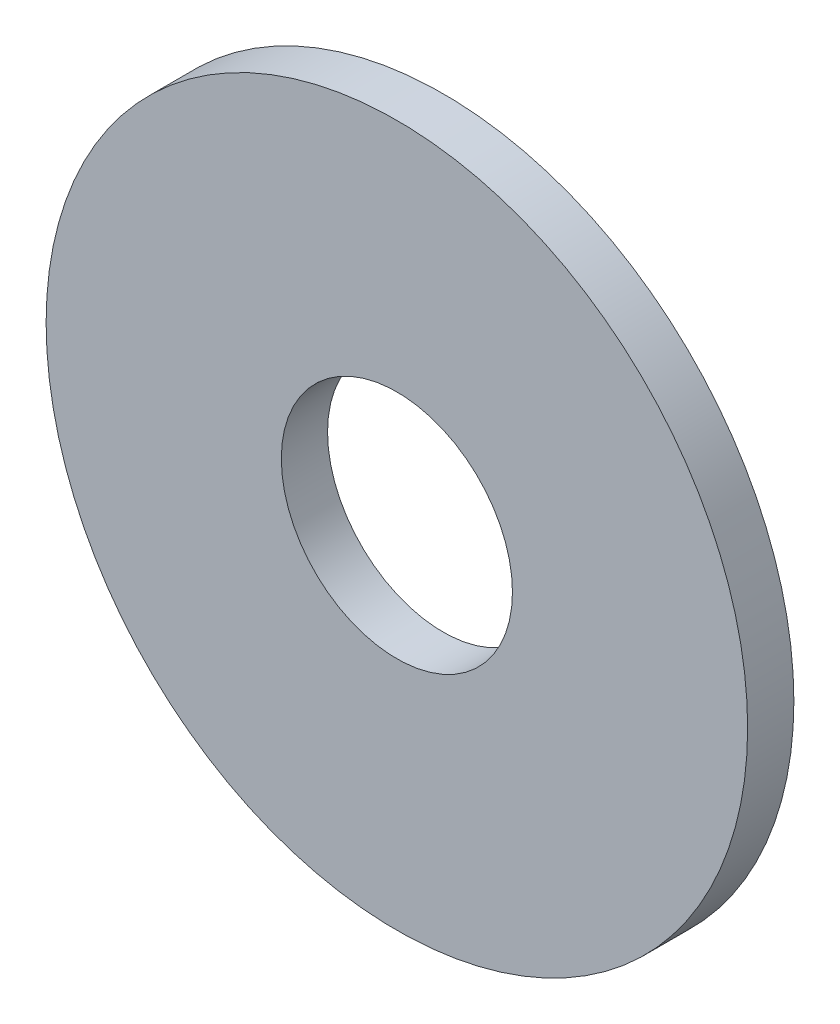
ISO-10303-21;
HEADER;
FILE_DESCRIPTION(('STEP AP214'),'2;1');
FILE_NAME('part.step','',(''),(''),'','','');
FILE_SCHEMA(('AUTOMOTIVE_DESIGN { 1 0 10303 214 1 1 1 1 }'));
ENDSEC;
DATA;
#1=APPLICATION_CONTEXT('core data for automotive mechanical design processes');
#2=APPLICATION_PROTOCOL_DEFINITION('international standard','automotive_design',2000,#1);
#3=PRODUCT_CONTEXT('',#1,'mechanical');
#4=PRODUCT('Part','Part','',(#3));
#5=PRODUCT_RELATED_PRODUCT_CATEGORY('part','',(#4));
#6=PRODUCT_DEFINITION_FORMATION('','',#4);
#7=PRODUCT_DEFINITION_CONTEXT('part definition',#1,'design');
#8=PRODUCT_DEFINITION('design','',#6,#7);
#9=PRODUCT_DEFINITION_SHAPE('','',#8);
#10=(LENGTH_UNIT() NAMED_UNIT(*) SI_UNIT(.MILLI.,.METRE.));
#11=(NAMED_UNIT(*) PLANE_ANGLE_UNIT() SI_UNIT($,.RADIAN.));
#12=(NAMED_UNIT(*) SI_UNIT($,.STERADIAN.) SOLID_ANGLE_UNIT());
#13=UNCERTAINTY_MEASURE_WITH_UNIT(LENGTH_MEASURE(1.E-05),#10,'distance_accuracy_value','');
#14=(GEOMETRIC_REPRESENTATION_CONTEXT(3) GLOBAL_UNCERTAINTY_ASSIGNED_CONTEXT((#13)) GLOBAL_UNIT_ASSIGNED_CONTEXT((#10,
#11,#12)) REPRESENTATION_CONTEXT('',''));
#15=CARTESIAN_POINT('',(0.,0.,0.));
#16=DIRECTION('',(0.,0.,1.));
#17=DIRECTION('',(1.,0.,0.));
#18=AXIS2_PLACEMENT_3D('',#15,#16,#17);
#19=CARTESIAN_POINT('',(0.,0.,1.));
#20=DIRECTION('',(0.,0.,1.));
#21=DIRECTION('',(1.,0.,0.));
#22=AXIS2_PLACEMENT_3D('',#19,#20,#21);
#23=PLANE('',#22);
#24=CARTESIAN_POINT('',(0.,0.,1.));
#25=DIRECTION('',(0.,0.,1.));
#26=DIRECTION('',(1.,0.,0.));
#27=AXIS2_PLACEMENT_3D('',#24,#25,#26);
#28=CIRCLE('',#27,7.5875);
#29=CARTESIAN_POINT('',(7.5875,0.,1.));
#30=VERTEX_POINT('',#29);
#31=EDGE_CURVE('E10',#30,#30,#28,.T.);
#32=ORIENTED_EDGE('',*,*,#31,.T.);
#33=EDGE_LOOP('',(#32));
#34=FACE_BOUND('',#33,.T.);
#35=CARTESIAN_POINT('',(0.,0.,1.));
#36=DIRECTION('',(0.,0.,1.));
#37=DIRECTION('',(1.,0.,0.));
#38=AXIS2_PLACEMENT_3D('',#35,#36,#37);
#39=CIRCLE('',#38,2.5);
#40=CARTESIAN_POINT('',(2.5,0.,1.));
#41=VERTEX_POINT('',#40);
#42=EDGE_CURVE('E50',#41,#41,#39,.T.);
#43=ORIENTED_EDGE('',*,*,#42,.F.);
#44=EDGE_LOOP('',(#43));
#45=FACE_BOUND('',#44,.T.);
#46=ADVANCED_FACE('F36',(#34,#45),#23,.T.);
#47=CARTESIAN_POINT('',(0.,0.,0.));
#48=DIRECTION('',(0.,0.,1.));
#49=DIRECTION('',(1.,0.,0.));
#50=AXIS2_PLACEMENT_3D('',#47,#48,#49);
#51=PLANE('',#50);
#52=CARTESIAN_POINT('',(0.,0.,0.));
#53=DIRECTION('',(0.,0.,1.));
#54=DIRECTION('',(1.,0.,0.));
#55=AXIS2_PLACEMENT_3D('',#52,#53,#54);
#56=CIRCLE('',#55,7.5875);
#57=CARTESIAN_POINT('',(7.5875,0.,0.));
#58=VERTEX_POINT('',#57);
#59=EDGE_CURVE('E40',#58,#58,#56,.T.);
#60=ORIENTED_EDGE('',*,*,#59,.F.);
#61=EDGE_LOOP('',(#60));
#62=FACE_BOUND('',#61,.T.);
#63=CARTESIAN_POINT('',(0.,0.,0.));
#64=DIRECTION('',(0.,0.,1.));
#65=DIRECTION('',(1.,0.,0.));
#66=AXIS2_PLACEMENT_3D('',#63,#64,#65);
#67=CIRCLE('',#66,2.5);
#68=CARTESIAN_POINT('',(2.5,0.,0.));
#69=VERTEX_POINT('',#68);
#70=EDGE_CURVE('E52',#69,#69,#67,.T.);
#71=ORIENTED_EDGE('',*,*,#70,.T.);
#72=EDGE_LOOP('',(#71));
#73=FACE_BOUND('',#72,.T.);
#74=ADVANCED_FACE('F65',(#62,#73),#51,.F.);
#75=CARTESIAN_POINT('',(0.,0.,1.));
#76=DIRECTION('',(0.,0.,-1.));
#77=DIRECTION('',(-1.,0.,0.));
#78=AXIS2_PLACEMENT_3D('',#75,#76,#77);
#79=CYLINDRICAL_SURFACE('',#78,7.5875);
#80=ORIENTED_EDGE('',*,*,#31,.F.);
#81=EDGE_LOOP('',(#80));
#82=FACE_BOUND('',#81,.T.);
#83=ORIENTED_EDGE('',*,*,#59,.T.);
#84=EDGE_LOOP('',(#83));
#85=FACE_BOUND('',#84,.T.);
#86=ADVANCED_FACE('F38',(#82,#85),#79,.T.);
#87=CARTESIAN_POINT('',(0.,0.,1.));
#88=DIRECTION('',(0.,0.,-1.));
#89=DIRECTION('',(-1.,0.,0.));
#90=AXIS2_PLACEMENT_3D('',#87,#88,#89);
#91=CYLINDRICAL_SURFACE('',#90,2.5);
#92=ORIENTED_EDGE('',*,*,#42,.T.);
#93=EDGE_LOOP('',(#92));
#94=FACE_BOUND('',#93,.T.);
#95=ORIENTED_EDGE('',*,*,#70,.F.);
#96=EDGE_LOOP('',(#95));
#97=FACE_BOUND('',#96,.T.);
#98=ADVANCED_FACE('F61',(#94,#97),#91,.F.);
#99=CLOSED_SHELL('',(#46,#74,#86,#98));
#100=MANIFOLD_SOLID_BREP('B2',#99);
#101=ADVANCED_BREP_SHAPE_REPRESENTATION('',(#18,#100),#14);
#102=SHAPE_DEFINITION_REPRESENTATION(#9,#101);
ENDSEC;
END-ISO-10303-21;
